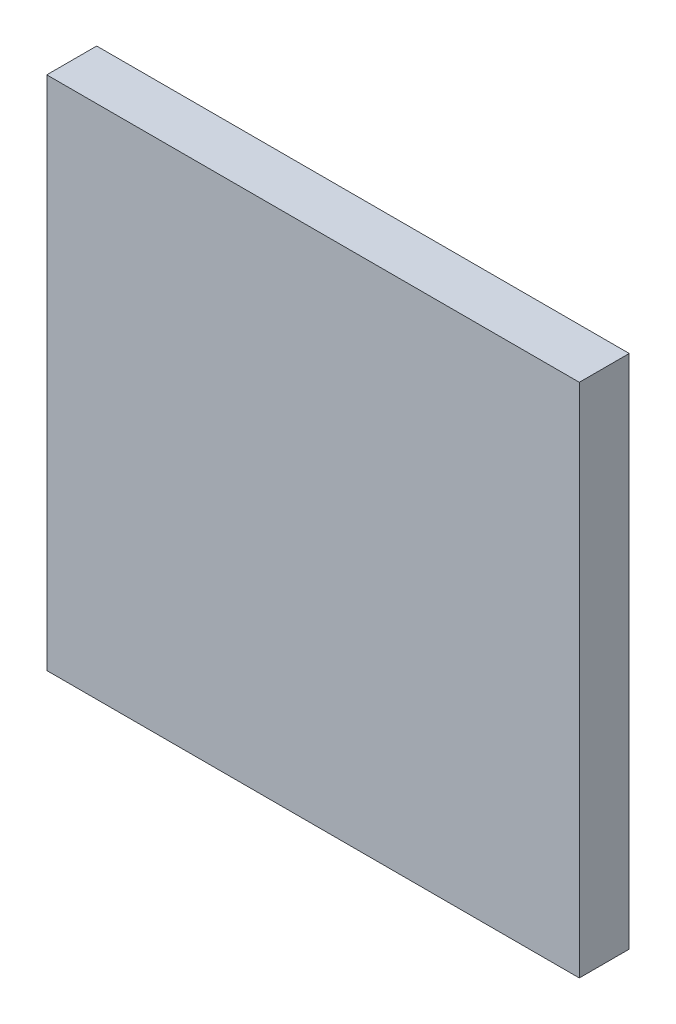
ISO-10303-21;
HEADER;
FILE_DESCRIPTION(('STEP AP214'),'2;1');
FILE_NAME('part.step','',(''),(''),'','','');
FILE_SCHEMA(('AUTOMOTIVE_DESIGN { 1 0 10303 214 1 1 1 1 }'));
ENDSEC;
DATA;
#1=APPLICATION_CONTEXT('core data for automotive mechanical design processes');
#2=APPLICATION_PROTOCOL_DEFINITION('international standard','automotive_design',2000,#1);
#3=PRODUCT_CONTEXT('',#1,'mechanical');
#4=PRODUCT('Part','Part','',(#3));
#5=PRODUCT_RELATED_PRODUCT_CATEGORY('part','',(#4));
#6=PRODUCT_DEFINITION_FORMATION('','',#4);
#7=PRODUCT_DEFINITION_CONTEXT('part definition',#1,'design');
#8=PRODUCT_DEFINITION('design','',#6,#7);
#9=PRODUCT_DEFINITION_SHAPE('','',#8);
#10=(LENGTH_UNIT() NAMED_UNIT(*) SI_UNIT(.MILLI.,.METRE.));
#11=(NAMED_UNIT(*) PLANE_ANGLE_UNIT() SI_UNIT($,.RADIAN.));
#12=(NAMED_UNIT(*) SI_UNIT($,.STERADIAN.) SOLID_ANGLE_UNIT());
#13=UNCERTAINTY_MEASURE_WITH_UNIT(LENGTH_MEASURE(1.E-05),#10,'distance_accuracy_value','');
#14=(GEOMETRIC_REPRESENTATION_CONTEXT(3) GLOBAL_UNCERTAINTY_ASSIGNED_CONTEXT((#13)) GLOBAL_UNIT_ASSIGNED_CONTEXT((#10,
#11,#12)) REPRESENTATION_CONTEXT('',''));
#15=CARTESIAN_POINT('',(0.,0.,0.));
#16=DIRECTION('',(0.,0.,1.));
#17=DIRECTION('',(1.,0.,0.));
#18=AXIS2_PLACEMENT_3D('',#15,#16,#17);
#19=CARTESIAN_POINT('',(0.,0.,-30.));
#20=DIRECTION('',(-1.,0.,0.));
#21=DIRECTION('',(0.,-1.,0.));
#22=AXIS2_PLACEMENT_3D('',#19,#20,#21);
#23=PLANE('',#22);
#24=DIRECTION('',(0.,-1.,0.));
#25=VECTOR('',#24,1.);
#26=CARTESIAN_POINT('',(0.,0.,0.));
#27=LINE('',#26,#25);
#28=CARTESIAN_POINT('',(0.,0.,0.));
#29=VERTEX_POINT('',#28);
#30=CARTESIAN_POINT('',(0.,-310.,0.));
#31=VERTEX_POINT('',#30);
#32=EDGE_CURVE('E101',#29,#31,#27,.T.);
#33=ORIENTED_EDGE('',*,*,#32,.F.);
#34=DIRECTION('',(0.,0.,1.));
#35=VECTOR('',#34,1.);
#36=CARTESIAN_POINT('',(0.,0.,-30.));
#37=LINE('',#36,#35);
#38=CARTESIAN_POINT('',(0.,0.,-30.));
#39=VERTEX_POINT('',#38);
#40=EDGE_CURVE('E11',#39,#29,#37,.T.);
#41=ORIENTED_EDGE('',*,*,#40,.F.);
#42=DIRECTION('',(0.,-1.,0.));
#43=VECTOR('',#42,1.);
#44=CARTESIAN_POINT('',(0.,0.,-30.));
#45=LINE('',#44,#43);
#46=CARTESIAN_POINT('',(0.,-310.,-30.));
#47=VERTEX_POINT('',#46);
#48=EDGE_CURVE('E95',#39,#47,#45,.T.);
#49=ORIENTED_EDGE('',*,*,#48,.T.);
#50=DIRECTION('',(0.,0.,1.));
#51=VECTOR('',#50,1.);
#52=CARTESIAN_POINT('',(0.,-310.,-30.));
#53=LINE('',#52,#51);
#54=EDGE_CURVE('E40',#47,#31,#53,.T.);
#55=ORIENTED_EDGE('',*,*,#54,.T.);
#56=EDGE_LOOP('',(#33,#41,#49,#55));
#57=FACE_BOUND('',#56,.T.);
#58=ADVANCED_FACE('F37',(#57),#23,.T.);
#59=CARTESIAN_POINT('',(0.,0.,-30.));
#60=DIRECTION('',(0.,1.,0.));
#61=DIRECTION('',(0.,0.,1.));
#62=AXIS2_PLACEMENT_3D('',#59,#60,#61);
#63=PLANE('',#62);
#64=DIRECTION('',(-1.,0.,0.));
#65=VECTOR('',#64,1.);
#66=CARTESIAN_POINT('',(0.,0.,0.));
#67=LINE('',#66,#65);
#68=CARTESIAN_POINT('',(320.,0.,0.));
#69=VERTEX_POINT('',#68);
#70=EDGE_CURVE('E97',#69,#29,#67,.T.);
#71=ORIENTED_EDGE('',*,*,#70,.F.);
#72=DIRECTION('',(0.,0.,1.));
#73=VECTOR('',#72,1.);
#74=CARTESIAN_POINT('',(320.,0.,-30.));
#75=LINE('',#74,#73);
#76=CARTESIAN_POINT('',(320.,0.,-30.));
#77=VERTEX_POINT('',#76);
#78=EDGE_CURVE('E46',#77,#69,#75,.T.);
#79=ORIENTED_EDGE('',*,*,#78,.F.);
#80=DIRECTION('',(-1.,0.,0.));
#81=VECTOR('',#80,1.);
#82=CARTESIAN_POINT('',(0.,0.,-30.));
#83=LINE('',#82,#81);
#84=EDGE_CURVE('E92',#77,#39,#83,.T.);
#85=ORIENTED_EDGE('',*,*,#84,.T.);
#86=ORIENTED_EDGE('',*,*,#40,.T.);
#87=EDGE_LOOP('',(#71,#79,#85,#86));
#88=FACE_BOUND('',#87,.T.);
#89=ADVANCED_FACE('F111',(#88),#63,.T.);
#90=CARTESIAN_POINT('',(320.,0.,-30.));
#91=DIRECTION('',(1.,0.,0.));
#92=DIRECTION('',(0.,1.,0.));
#93=AXIS2_PLACEMENT_3D('',#90,#91,#92);
#94=PLANE('',#93);
#95=DIRECTION('',(0.,1.,0.));
#96=VECTOR('',#95,1.);
#97=CARTESIAN_POINT('',(320.,0.,0.));
#98=LINE('',#97,#96);
#99=CARTESIAN_POINT('',(320.,-310.,0.));
#100=VERTEX_POINT('',#99);
#101=EDGE_CURVE('E87',#100,#69,#98,.T.);
#102=ORIENTED_EDGE('',*,*,#101,.F.);
#103=DIRECTION('',(0.,0.,1.));
#104=VECTOR('',#103,1.);
#105=CARTESIAN_POINT('',(320.,-310.,-30.));
#106=LINE('',#105,#104);
#107=CARTESIAN_POINT('',(320.,-310.,-30.));
#108=VERTEX_POINT('',#107);
#109=EDGE_CURVE('E82',#108,#100,#106,.T.);
#110=ORIENTED_EDGE('',*,*,#109,.F.);
#111=DIRECTION('',(0.,1.,0.));
#112=VECTOR('',#111,1.);
#113=CARTESIAN_POINT('',(320.,0.,-30.));
#114=LINE('',#113,#112);
#115=EDGE_CURVE('E85',#108,#77,#114,.T.);
#116=ORIENTED_EDGE('',*,*,#115,.T.);
#117=ORIENTED_EDGE('',*,*,#78,.T.);
#118=EDGE_LOOP('',(#102,#110,#116,#117));
#119=FACE_BOUND('',#118,.T.);
#120=ADVANCED_FACE('F84',(#119),#94,.T.);
#121=CARTESIAN_POINT('',(0.,-310.,-30.));
#122=DIRECTION('',(0.,-1.,0.));
#123=DIRECTION('',(0.,0.,-1.));
#124=AXIS2_PLACEMENT_3D('',#121,#122,#123);
#125=PLANE('',#124);
#126=DIRECTION('',(1.,0.,0.));
#127=VECTOR('',#126,1.);
#128=CARTESIAN_POINT('',(0.,-310.,0.));
#129=LINE('',#128,#127);
#130=EDGE_CURVE('E104',#31,#100,#129,.T.);
#131=ORIENTED_EDGE('',*,*,#130,.F.);
#132=ORIENTED_EDGE('',*,*,#54,.F.);
#133=DIRECTION('',(1.,0.,0.));
#134=VECTOR('',#133,1.);
#135=CARTESIAN_POINT('',(0.,-310.,-30.));
#136=LINE('',#135,#134);
#137=EDGE_CURVE('E91',#47,#108,#136,.T.);
#138=ORIENTED_EDGE('',*,*,#137,.T.);
#139=ORIENTED_EDGE('',*,*,#109,.T.);
#140=EDGE_LOOP('',(#131,#132,#138,#139));
#141=FACE_BOUND('',#140,.T.);
#142=ADVANCED_FACE('F94',(#141),#125,.T.);
#143=CARTESIAN_POINT('',(0.,0.,-30.));
#144=DIRECTION('',(0.,0.,1.));
#145=DIRECTION('',(1.,0.,0.));
#146=AXIS2_PLACEMENT_3D('',#143,#144,#145);
#147=PLANE('',#146);
#148=ORIENTED_EDGE('',*,*,#48,.F.);
#149=ORIENTED_EDGE('',*,*,#84,.F.);
#150=ORIENTED_EDGE('',*,*,#115,.F.);
#151=ORIENTED_EDGE('',*,*,#137,.F.);
#152=EDGE_LOOP('',(#148,#149,#150,#151));
#153=FACE_BOUND('',#152,.T.);
#154=ADVANCED_FACE('F90',(#153),#147,.F.);
#155=CARTESIAN_POINT('',(0.,0.,0.));
#156=DIRECTION('',(0.,0.,1.));
#157=DIRECTION('',(1.,0.,0.));
#158=AXIS2_PLACEMENT_3D('',#155,#156,#157);
#159=PLANE('',#158);
#160=ORIENTED_EDGE('',*,*,#32,.T.);
#161=ORIENTED_EDGE('',*,*,#130,.T.);
#162=ORIENTED_EDGE('',*,*,#101,.T.);
#163=ORIENTED_EDGE('',*,*,#70,.T.);
#164=EDGE_LOOP('',(#160,#161,#162,#163));
#165=FACE_BOUND('',#164,.T.);
#166=ADVANCED_FACE('F110',(#165),#159,.T.);
#167=CLOSED_SHELL('',(#58,#89,#120,#142,#154,#166));
#168=MANIFOLD_SOLID_BREP('B2',#167);
#169=ADVANCED_BREP_SHAPE_REPRESENTATION('',(#18,#168),#14);
#170=SHAPE_DEFINITION_REPRESENTATION(#9,#169);
ENDSEC;
END-ISO-10303-21;
